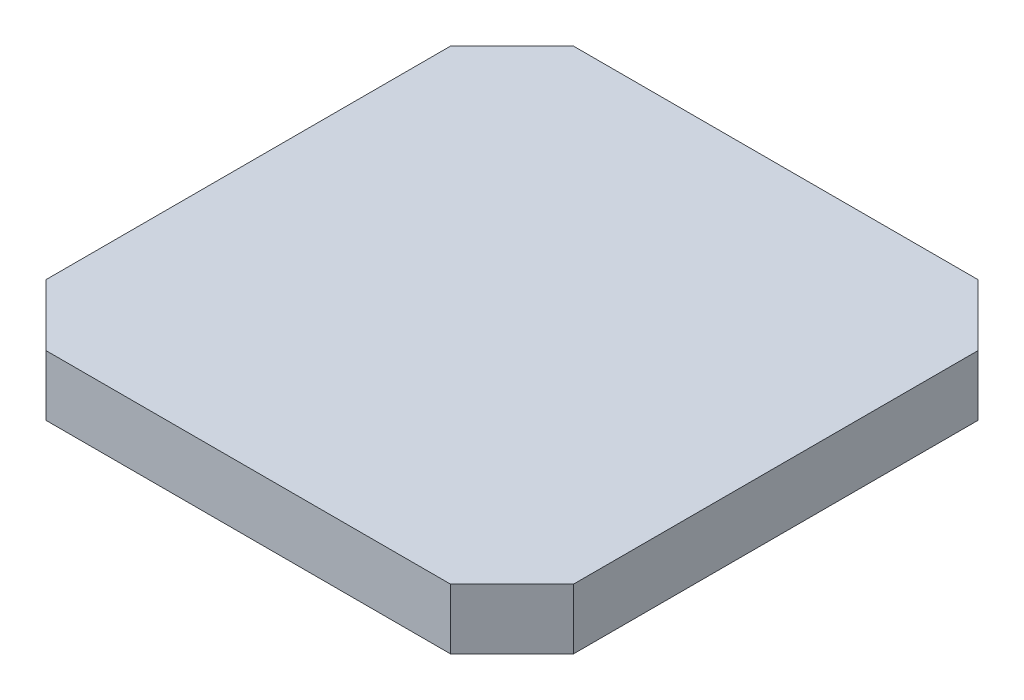
ISO-10303-21;
HEADER;
FILE_DESCRIPTION(('STEP AP214'),'2;1');
FILE_NAME('part.step','',(''),(''),'','','');
FILE_SCHEMA(('AUTOMOTIVE_DESIGN { 1 0 10303 214 1 1 1 1 }'));
ENDSEC;
DATA;
#1=APPLICATION_CONTEXT('core data for automotive mechanical design processes');
#2=APPLICATION_PROTOCOL_DEFINITION('international standard','automotive_design',2000,#1);
#3=PRODUCT_CONTEXT('',#1,'mechanical');
#4=PRODUCT('Part','Part','',(#3));
#5=PRODUCT_RELATED_PRODUCT_CATEGORY('part','',(#4));
#6=PRODUCT_DEFINITION_FORMATION('','',#4);
#7=PRODUCT_DEFINITION_CONTEXT('part definition',#1,'design');
#8=PRODUCT_DEFINITION('design','',#6,#7);
#9=PRODUCT_DEFINITION_SHAPE('','',#8);
#10=(LENGTH_UNIT() NAMED_UNIT(*) SI_UNIT(.MILLI.,.METRE.));
#11=(NAMED_UNIT(*) PLANE_ANGLE_UNIT() SI_UNIT($,.RADIAN.));
#12=(NAMED_UNIT(*) SI_UNIT($,.STERADIAN.) SOLID_ANGLE_UNIT());
#13=UNCERTAINTY_MEASURE_WITH_UNIT(LENGTH_MEASURE(1.E-05),#10,'distance_accuracy_value','');
#14=(GEOMETRIC_REPRESENTATION_CONTEXT(3) GLOBAL_UNCERTAINTY_ASSIGNED_CONTEXT((#13)) GLOBAL_UNIT_ASSIGNED_CONTEXT((#10,
#11,#12)) REPRESENTATION_CONTEXT('',''));
#15=CARTESIAN_POINT('',(0.,0.,0.));
#16=DIRECTION('',(0.,0.,1.));
#17=DIRECTION('',(1.,0.,0.));
#18=AXIS2_PLACEMENT_3D('',#15,#16,#17);
#19=CARTESIAN_POINT('',(208.5,-14.4,46.5));
#20=DIRECTION('',(0.707106781186547,0.,0.707106781186548));
#21=DIRECTION('',(0.707106781186548,0.,-0.707106781186547));
#22=AXIS2_PLACEMENT_3D('',#19,#20,#21);
#23=PLANE('',#22);
#24=DIRECTION('',(0.707106781186548,0.,-0.707106781186547));
#25=VECTOR('',#24,1.);
#26=CARTESIAN_POINT('',(208.5,-2.6,46.5));
#27=LINE('',#26,#25);
#28=CARTESIAN_POINT('',(208.5,-2.6,46.5));
#29=VERTEX_POINT('',#28);
#30=CARTESIAN_POINT('',(220.5,-2.6,34.5));
#31=VERTEX_POINT('',#30);
#32=EDGE_CURVE('E84',#29,#31,#27,.T.);
#33=ORIENTED_EDGE('',*,*,#32,.T.);
#34=DIRECTION('',(0.,1.,0.));
#35=VECTOR('',#34,1.);
#36=CARTESIAN_POINT('',(220.5,-14.4,34.5));
#37=LINE('',#36,#35);
#38=CARTESIAN_POINT('',(220.5,-14.4,34.5));
#39=VERTEX_POINT('',#38);
#40=EDGE_CURVE('E11',#39,#31,#37,.T.);
#41=ORIENTED_EDGE('',*,*,#40,.F.);
#42=DIRECTION('',(0.707106781186548,0.,-0.707106781186547));
#43=VECTOR('',#42,1.);
#44=CARTESIAN_POINT('',(208.5,-14.4,46.5));
#45=LINE('',#44,#43);
#46=CARTESIAN_POINT('',(208.5,-14.4,46.5));
#47=VERTEX_POINT('',#46);
#48=EDGE_CURVE('E87',#47,#39,#45,.T.);
#49=ORIENTED_EDGE('',*,*,#48,.F.);
#50=DIRECTION('',(0.,1.,0.));
#51=VECTOR('',#50,1.);
#52=CARTESIAN_POINT('',(208.5,-14.4,46.5));
#53=LINE('',#52,#51);
#54=EDGE_CURVE('E95',#47,#29,#53,.T.);
#55=ORIENTED_EDGE('',*,*,#54,.T.);
#56=EDGE_LOOP('',(#33,#41,#49,#55));
#57=FACE_BOUND('',#56,.T.);
#58=ADVANCED_FACE('F17',(#57),#23,.F.);
#59=CARTESIAN_POINT('',(220.5,-14.4,34.5));
#60=DIRECTION('',(0.,0.,1.));
#61=DIRECTION('',(1.,0.,0.));
#62=AXIS2_PLACEMENT_3D('',#59,#60,#61);
#63=PLANE('',#62);
#64=DIRECTION('',(1.,0.,0.));
#65=VECTOR('',#64,1.);
#66=CARTESIAN_POINT('',(220.5,-2.6,34.5));
#67=LINE('',#66,#65);
#68=CARTESIAN_POINT('',(299.5,-2.6,34.5));
#69=VERTEX_POINT('',#68);
#70=EDGE_CURVE('E107',#31,#69,#67,.T.);
#71=ORIENTED_EDGE('',*,*,#70,.T.);
#72=DIRECTION('',(0.,1.,0.));
#73=VECTOR('',#72,1.);
#74=CARTESIAN_POINT('',(299.5,-14.4,34.5));
#75=LINE('',#74,#73);
#76=CARTESIAN_POINT('',(299.5,-14.4,34.5));
#77=VERTEX_POINT('',#76);
#78=EDGE_CURVE('E25',#77,#69,#75,.T.);
#79=ORIENTED_EDGE('',*,*,#78,.F.);
#80=DIRECTION('',(1.,0.,0.));
#81=VECTOR('',#80,1.);
#82=CARTESIAN_POINT('',(220.5,-14.4,34.5));
#83=LINE('',#82,#81);
#84=EDGE_CURVE('E130',#39,#77,#83,.T.);
#85=ORIENTED_EDGE('',*,*,#84,.F.);
#86=ORIENTED_EDGE('',*,*,#40,.T.);
#87=EDGE_LOOP('',(#71,#79,#85,#86));
#88=FACE_BOUND('',#87,.T.);
#89=ADVANCED_FACE('F129',(#88),#63,.F.);
#90=CARTESIAN_POINT('',(311.5,-14.4,46.5));
#91=DIRECTION('',(-0.707106781186548,0.,0.707106781186547));
#92=DIRECTION('',(0.707106781186547,0.,0.707106781186548));
#93=AXIS2_PLACEMENT_3D('',#90,#91,#92);
#94=PLANE('',#93);
#95=DIRECTION('',(0.707106781186547,0.,0.707106781186548));
#96=VECTOR('',#95,1.);
#97=CARTESIAN_POINT('',(311.5,-2.6,46.5));
#98=LINE('',#97,#96);
#99=CARTESIAN_POINT('',(311.5,-2.6,46.5));
#100=VERTEX_POINT('',#99);
#101=EDGE_CURVE('E125',#69,#100,#98,.T.);
#102=ORIENTED_EDGE('',*,*,#101,.T.);
#103=DIRECTION('',(0.,1.,0.));
#104=VECTOR('',#103,1.);
#105=CARTESIAN_POINT('',(311.5,-14.4,46.5));
#106=LINE('',#105,#104);
#107=CARTESIAN_POINT('',(311.5,-14.4,46.5));
#108=VERTEX_POINT('',#107);
#109=EDGE_CURVE('E116',#108,#100,#106,.T.);
#110=ORIENTED_EDGE('',*,*,#109,.F.);
#111=DIRECTION('',(0.707106781186547,0.,0.707106781186548));
#112=VECTOR('',#111,1.);
#113=CARTESIAN_POINT('',(311.5,-14.4,46.5));
#114=LINE('',#113,#112);
#115=EDGE_CURVE('E126',#77,#108,#114,.T.);
#116=ORIENTED_EDGE('',*,*,#115,.F.);
#117=ORIENTED_EDGE('',*,*,#78,.T.);
#118=EDGE_LOOP('',(#102,#110,#116,#117));
#119=FACE_BOUND('',#118,.T.);
#120=ADVANCED_FACE('F123',(#119),#94,.F.);
#121=CARTESIAN_POINT('',(311.5,-14.4,46.5));
#122=DIRECTION('',(-1.,0.,0.));
#123=DIRECTION('',(0.,0.,1.));
#124=AXIS2_PLACEMENT_3D('',#121,#122,#123);
#125=PLANE('',#124);
#126=DIRECTION('',(0.,0.,1.));
#127=VECTOR('',#126,1.);
#128=CARTESIAN_POINT('',(311.5,-2.6,46.5));
#129=LINE('',#128,#127);
#130=CARTESIAN_POINT('',(311.5,-2.6,125.5));
#131=VERTEX_POINT('',#130);
#132=EDGE_CURVE('E133',#100,#131,#129,.T.);
#133=ORIENTED_EDGE('',*,*,#132,.T.);
#134=DIRECTION('',(0.,1.,0.));
#135=VECTOR('',#134,1.);
#136=CARTESIAN_POINT('',(311.5,-14.4,125.5));
#137=LINE('',#136,#135);
#138=CARTESIAN_POINT('',(311.5,-14.4,125.5));
#139=VERTEX_POINT('',#138);
#140=EDGE_CURVE('E113',#139,#131,#137,.T.);
#141=ORIENTED_EDGE('',*,*,#140,.F.);
#142=DIRECTION('',(0.,0.,1.));
#143=VECTOR('',#142,1.);
#144=CARTESIAN_POINT('',(311.5,-14.4,46.5));
#145=LINE('',#144,#143);
#146=EDGE_CURVE('E153',#108,#139,#145,.T.);
#147=ORIENTED_EDGE('',*,*,#146,.F.);
#148=ORIENTED_EDGE('',*,*,#109,.T.);
#149=EDGE_LOOP('',(#133,#141,#147,#148));
#150=FACE_BOUND('',#149,.T.);
#151=ADVANCED_FACE('F169',(#150),#125,.F.);
#152=CARTESIAN_POINT('',(299.5,-14.4,137.5));
#153=DIRECTION('',(-0.707106781186548,0.,-0.707106781186548));
#154=DIRECTION('',(-0.707106781186548,0.,0.707106781186548));
#155=AXIS2_PLACEMENT_3D('',#152,#153,#154);
#156=PLANE('',#155);
#157=DIRECTION('',(-0.707106781186548,0.,0.707106781186548));
#158=VECTOR('',#157,1.);
#159=CARTESIAN_POINT('',(299.5,-2.6,137.5));
#160=LINE('',#159,#158);
#161=CARTESIAN_POINT('',(299.5,-2.6,137.5));
#162=VERTEX_POINT('',#161);
#163=EDGE_CURVE('E102',#131,#162,#160,.T.);
#164=ORIENTED_EDGE('',*,*,#163,.T.);
#165=DIRECTION('',(0.,1.,0.));
#166=VECTOR('',#165,1.);
#167=CARTESIAN_POINT('',(299.5,-14.4,137.5));
#168=LINE('',#167,#166);
#169=CARTESIAN_POINT('',(299.5,-14.4,137.5));
#170=VERTEX_POINT('',#169);
#171=EDGE_CURVE('E110',#170,#162,#168,.T.);
#172=ORIENTED_EDGE('',*,*,#171,.F.);
#173=DIRECTION('',(-0.707106781186548,0.,0.707106781186548));
#174=VECTOR('',#173,1.);
#175=CARTESIAN_POINT('',(299.5,-14.4,137.5));
#176=LINE('',#175,#174);
#177=EDGE_CURVE('E150',#139,#170,#176,.T.);
#178=ORIENTED_EDGE('',*,*,#177,.F.);
#179=ORIENTED_EDGE('',*,*,#140,.T.);
#180=EDGE_LOOP('',(#164,#172,#178,#179));
#181=FACE_BOUND('',#180,.T.);
#182=ADVANCED_FACE('F142',(#181),#156,.F.);
#183=CARTESIAN_POINT('',(299.5,-14.4,137.5));
#184=DIRECTION('',(0.,0.,-1.));
#185=DIRECTION('',(-1.,0.,0.));
#186=AXIS2_PLACEMENT_3D('',#183,#184,#185);
#187=PLANE('',#186);
#188=DIRECTION('',(-1.,0.,0.));
#189=VECTOR('',#188,1.);
#190=CARTESIAN_POINT('',(299.5,-2.6,137.5));
#191=LINE('',#190,#189);
#192=CARTESIAN_POINT('',(220.5,-2.6,137.5));
#193=VERTEX_POINT('',#192);
#194=EDGE_CURVE('E100',#162,#193,#191,.T.);
#195=ORIENTED_EDGE('',*,*,#194,.T.);
#196=DIRECTION('',(0.,1.,0.));
#197=VECTOR('',#196,1.);
#198=CARTESIAN_POINT('',(220.5,-14.4,137.5));
#199=LINE('',#198,#197);
#200=CARTESIAN_POINT('',(220.5,-14.4,137.5));
#201=VERTEX_POINT('',#200);
#202=EDGE_CURVE('E94',#201,#193,#199,.T.);
#203=ORIENTED_EDGE('',*,*,#202,.F.);
#204=DIRECTION('',(-1.,0.,0.));
#205=VECTOR('',#204,1.);
#206=CARTESIAN_POINT('',(299.5,-14.4,137.5));
#207=LINE('',#206,#205);
#208=EDGE_CURVE('E148',#170,#201,#207,.T.);
#209=ORIENTED_EDGE('',*,*,#208,.F.);
#210=ORIENTED_EDGE('',*,*,#171,.T.);
#211=EDGE_LOOP('',(#195,#203,#209,#210));
#212=FACE_BOUND('',#211,.T.);
#213=ADVANCED_FACE('F147',(#212),#187,.F.);
#214=CARTESIAN_POINT('',(208.5,-14.4,125.5));
#215=DIRECTION('',(0.707106781186548,0.,-0.707106781186547));
#216=DIRECTION('',(-0.707106781186547,0.,-0.707106781186548));
#217=AXIS2_PLACEMENT_3D('',#214,#215,#216);
#218=PLANE('',#217);
#219=DIRECTION('',(-0.707106781186547,0.,-0.707106781186548));
#220=VECTOR('',#219,1.);
#221=CARTESIAN_POINT('',(208.5,-2.6,125.5));
#222=LINE('',#221,#220);
#223=CARTESIAN_POINT('',(208.5,-2.6,125.5));
#224=VERTEX_POINT('',#223);
#225=EDGE_CURVE('E81',#193,#224,#222,.T.);
#226=ORIENTED_EDGE('',*,*,#225,.T.);
#227=DIRECTION('',(0.,1.,0.));
#228=VECTOR('',#227,1.);
#229=CARTESIAN_POINT('',(208.5,-14.4,125.5));
#230=LINE('',#229,#228);
#231=CARTESIAN_POINT('',(208.5,-14.4,125.5));
#232=VERTEX_POINT('',#231);
#233=EDGE_CURVE('E90',#232,#224,#230,.T.);
#234=ORIENTED_EDGE('',*,*,#233,.F.);
#235=DIRECTION('',(-0.707106781186547,0.,-0.707106781186548));
#236=VECTOR('',#235,1.);
#237=CARTESIAN_POINT('',(208.5,-14.4,125.5));
#238=LINE('',#237,#236);
#239=EDGE_CURVE('E149',#201,#232,#238,.T.);
#240=ORIENTED_EDGE('',*,*,#239,.F.);
#241=ORIENTED_EDGE('',*,*,#202,.T.);
#242=EDGE_LOOP('',(#226,#234,#240,#241));
#243=FACE_BOUND('',#242,.T.);
#244=ADVANCED_FACE('F98',(#243),#218,.F.);
#245=CARTESIAN_POINT('',(208.5,-14.4,125.5));
#246=DIRECTION('',(1.,0.,0.));
#247=DIRECTION('',(0.,0.,-1.));
#248=AXIS2_PLACEMENT_3D('',#245,#246,#247);
#249=PLANE('',#248);
#250=DIRECTION('',(0.,0.,-1.));
#251=VECTOR('',#250,1.);
#252=CARTESIAN_POINT('',(208.5,-2.6,125.5));
#253=LINE('',#252,#251);
#254=EDGE_CURVE('E77',#224,#29,#253,.T.);
#255=ORIENTED_EDGE('',*,*,#254,.T.);
#256=ORIENTED_EDGE('',*,*,#54,.F.);
#257=DIRECTION('',(0.,0.,-1.));
#258=VECTOR('',#257,1.);
#259=CARTESIAN_POINT('',(208.5,-14.4,125.5));
#260=LINE('',#259,#258);
#261=EDGE_CURVE('E32',#232,#47,#260,.T.);
#262=ORIENTED_EDGE('',*,*,#261,.F.);
#263=ORIENTED_EDGE('',*,*,#233,.T.);
#264=EDGE_LOOP('',(#255,#256,#262,#263));
#265=FACE_BOUND('',#264,.T.);
#266=ADVANCED_FACE('F91',(#265),#249,.F.);
#267=CARTESIAN_POINT('',(260.,-14.4,86.));
#268=DIRECTION('',(0.,-1.,0.));
#269=DIRECTION('',(0.,0.,-1.));
#270=AXIS2_PLACEMENT_3D('',#267,#268,#269);
#271=PLANE('',#270);
#272=ORIENTED_EDGE('',*,*,#48,.T.);
#273=ORIENTED_EDGE('',*,*,#84,.T.);
#274=ORIENTED_EDGE('',*,*,#115,.T.);
#275=ORIENTED_EDGE('',*,*,#146,.T.);
#276=ORIENTED_EDGE('',*,*,#177,.T.);
#277=ORIENTED_EDGE('',*,*,#208,.T.);
#278=ORIENTED_EDGE('',*,*,#239,.T.);
#279=ORIENTED_EDGE('',*,*,#261,.T.);
#280=EDGE_LOOP('',(#272,#273,#274,#275,#276,#277,#278,#279));
#281=FACE_BOUND('',#280,.T.);
#282=ADVANCED_FACE('F159',(#281),#271,.T.);
#283=CARTESIAN_POINT('',(0.,-2.6,0.));
#284=DIRECTION('',(0.,1.,0.));
#285=DIRECTION('',(0.,0.,1.));
#286=AXIS2_PLACEMENT_3D('',#283,#284,#285);
#287=PLANE('',#286);
#288=ORIENTED_EDGE('',*,*,#32,.F.);
#289=ORIENTED_EDGE('',*,*,#254,.F.);
#290=ORIENTED_EDGE('',*,*,#225,.F.);
#291=ORIENTED_EDGE('',*,*,#194,.F.);
#292=ORIENTED_EDGE('',*,*,#163,.F.);
#293=ORIENTED_EDGE('',*,*,#132,.F.);
#294=ORIENTED_EDGE('',*,*,#101,.F.);
#295=ORIENTED_EDGE('',*,*,#70,.F.);
#296=EDGE_LOOP('',(#288,#289,#290,#291,#292,#293,#294,#295));
#297=FACE_BOUND('',#296,.T.);
#298=ADVANCED_FACE('F79',(#297),#287,.T.);
#299=CLOSED_SHELL('',(#58,#89,#120,#151,#182,#213,#244,#266,#282,#298));
#300=MANIFOLD_SOLID_BREP('B1',#299);
#301=ADVANCED_BREP_SHAPE_REPRESENTATION('',(#18,#300),#14);
#302=SHAPE_DEFINITION_REPRESENTATION(#9,#301);
ENDSEC;
END-ISO-10303-21;
